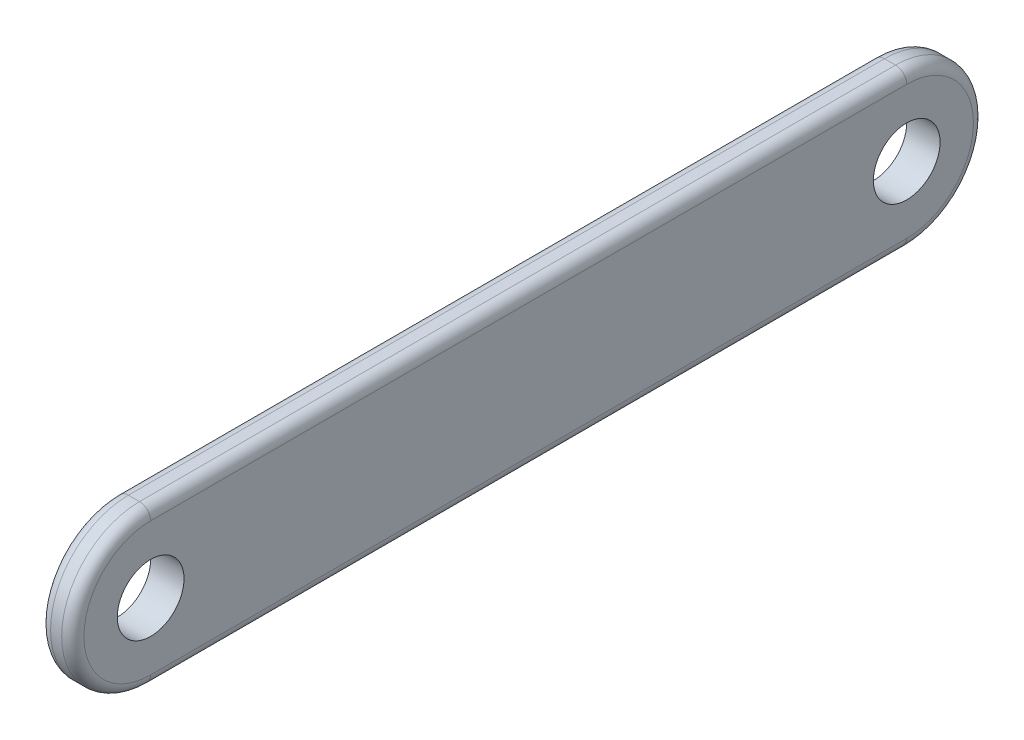
ISO-10303-21;
HEADER;
FILE_DESCRIPTION(('STEP AP214'),'2;1');
FILE_NAME('part.step','',(''),(''),'','','');
FILE_SCHEMA(('AUTOMOTIVE_DESIGN { 1 0 10303 214 1 1 1 1 }'));
ENDSEC;
DATA;
#1=APPLICATION_CONTEXT('core data for automotive mechanical design processes');
#2=APPLICATION_PROTOCOL_DEFINITION('international standard','automotive_design',2000,#1);
#3=PRODUCT_CONTEXT('',#1,'mechanical');
#4=PRODUCT('Part','Part','',(#3));
#5=PRODUCT_RELATED_PRODUCT_CATEGORY('part','',(#4));
#6=PRODUCT_DEFINITION_FORMATION('','',#4);
#7=PRODUCT_DEFINITION_CONTEXT('part definition',#1,'design');
#8=PRODUCT_DEFINITION('design','',#6,#7);
#9=PRODUCT_DEFINITION_SHAPE('','',#8);
#10=(LENGTH_UNIT() NAMED_UNIT(*) SI_UNIT(.MILLI.,.METRE.));
#11=(NAMED_UNIT(*) PLANE_ANGLE_UNIT() SI_UNIT($,.RADIAN.));
#12=(NAMED_UNIT(*) SI_UNIT($,.STERADIAN.) SOLID_ANGLE_UNIT());
#13=UNCERTAINTY_MEASURE_WITH_UNIT(LENGTH_MEASURE(1.E-05),#10,'distance_accuracy_value','');
#14=(GEOMETRIC_REPRESENTATION_CONTEXT(3) GLOBAL_UNCERTAINTY_ASSIGNED_CONTEXT((#13)) GLOBAL_UNIT_ASSIGNED_CONTEXT((#10,
#11,#12)) REPRESENTATION_CONTEXT('',''));
#15=CARTESIAN_POINT('',(0.,0.,0.));
#16=DIRECTION('',(0.,0.,1.));
#17=DIRECTION('',(1.,0.,0.));
#18=AXIS2_PLACEMENT_3D('',#15,#16,#17);
#19=CARTESIAN_POINT('',(3.,0.,34.));
#20=DIRECTION('',(1.,0.,0.));
#21=DIRECTION('',(0.,0.,-1.));
#22=AXIS2_PLACEMENT_3D('',#19,#20,#21);
#23=PLANE('',#22);
#24=CARTESIAN_POINT('',(3.,0.,-34.));
#25=DIRECTION('',(1.,0.,0.));
#26=DIRECTION('',(0.,0.,-1.));
#27=AXIS2_PLACEMENT_3D('',#24,#25,#26);
#28=CIRCLE('',#27,6.00000000000002);
#29=CARTESIAN_POINT('',(3.,-6.00000000000002,-34.));
#30=VERTEX_POINT('',#29);
#31=CARTESIAN_POINT('',(3.,6.00000000000002,-34.));
#32=VERTEX_POINT('',#31);
#33=EDGE_CURVE('E53',#30,#32,#28,.T.);
#34=ORIENTED_EDGE('',*,*,#33,.T.);
#35=DIRECTION('',(0.,0.,1.));
#36=VECTOR('',#35,1.);
#37=CARTESIAN_POINT('',(3.,6.00000000000002,34.));
#38=LINE('',#37,#36);
#39=CARTESIAN_POINT('',(3.,6.00000000000002,34.));
#40=VERTEX_POINT('',#39);
#41=EDGE_CURVE('E112',#32,#40,#38,.T.);
#42=ORIENTED_EDGE('',*,*,#41,.T.);
#43=CARTESIAN_POINT('',(3.,0.,34.));
#44=DIRECTION('',(1.,0.,0.));
#45=DIRECTION('',(0.,0.,-1.));
#46=AXIS2_PLACEMENT_3D('',#43,#44,#45);
#47=CIRCLE('',#46,6.00000000000002);
#48=CARTESIAN_POINT('',(3.,-6.00000000000001,34.));
#49=VERTEX_POINT('',#48);
#50=EDGE_CURVE('E136',#40,#49,#47,.T.);
#51=ORIENTED_EDGE('',*,*,#50,.T.);
#52=DIRECTION('',(0.,0.,-1.));
#53=VECTOR('',#52,1.);
#54=CARTESIAN_POINT('',(3.,-6.00000000000002,-34.));
#55=LINE('',#54,#53);
#56=EDGE_CURVE('E58',#49,#30,#55,.T.);
#57=ORIENTED_EDGE('',*,*,#56,.T.);
#58=EDGE_LOOP('',(#34,#42,#51,#57));
#59=FACE_BOUND('',#58,.T.);
#60=CARTESIAN_POINT('',(3.,0.,34.));
#61=DIRECTION('',(1.,0.,0.));
#62=DIRECTION('',(0.,0.,-1.));
#63=AXIS2_PLACEMENT_3D('',#60,#61,#62);
#64=CIRCLE('',#63,2.99999999999999);
#65=CARTESIAN_POINT('',(3.,0.,31.));
#66=VERTEX_POINT('',#65);
#67=EDGE_CURVE('E125',#66,#66,#64,.T.);
#68=ORIENTED_EDGE('',*,*,#67,.F.);
#69=EDGE_LOOP('',(#68));
#70=FACE_BOUND('',#69,.T.);
#71=CARTESIAN_POINT('',(3.,0.,-34.));
#72=DIRECTION('',(1.,0.,0.));
#73=DIRECTION('',(0.,0.,-1.));
#74=AXIS2_PLACEMENT_3D('',#71,#72,#73);
#75=CIRCLE('',#74,2.99999999999999);
#76=CARTESIAN_POINT('',(3.,0.,-37.));
#77=VERTEX_POINT('',#76);
#78=EDGE_CURVE('E165',#77,#77,#75,.T.);
#79=ORIENTED_EDGE('',*,*,#78,.F.);
#80=EDGE_LOOP('',(#79));
#81=FACE_BOUND('',#80,.T.);
#82=ADVANCED_FACE('F36',(#59,#70,#81),#23,.T.);
#83=CARTESIAN_POINT('',(0.,0.,34.));
#84=DIRECTION('',(1.,0.,0.));
#85=DIRECTION('',(0.,0.,-1.));
#86=AXIS2_PLACEMENT_3D('',#83,#84,#85);
#87=PLANE('',#86);
#88=CARTESIAN_POINT('',(0.,0.,34.));
#89=DIRECTION('',(1.,0.,0.));
#90=DIRECTION('',(0.,0.,-1.));
#91=AXIS2_PLACEMENT_3D('',#88,#89,#90);
#92=CIRCLE('',#91,6.00000000000002);
#93=CARTESIAN_POINT('',(0.,-6.00000000000001,34.));
#94=VERTEX_POINT('',#93);
#95=CARTESIAN_POINT('',(0.,6.00000000000002,34.));
#96=VERTEX_POINT('',#95);
#97=EDGE_CURVE('E183',#94,#96,#92,.F.);
#98=ORIENTED_EDGE('',*,*,#97,.T.);
#99=DIRECTION('',(0.,0.,1.));
#100=VECTOR('',#99,1.);
#101=CARTESIAN_POINT('',(0.,6.00000000000002,34.));
#102=LINE('',#101,#100);
#103=CARTESIAN_POINT('',(0.,6.00000000000002,-34.));
#104=VERTEX_POINT('',#103);
#105=EDGE_CURVE('E189',#96,#104,#102,.F.);
#106=ORIENTED_EDGE('',*,*,#105,.T.);
#107=CARTESIAN_POINT('',(0.,0.,-34.));
#108=DIRECTION('',(1.,0.,0.));
#109=DIRECTION('',(0.,0.,-1.));
#110=AXIS2_PLACEMENT_3D('',#107,#108,#109);
#111=CIRCLE('',#110,6.00000000000002);
#112=CARTESIAN_POINT('',(0.,-6.00000000000002,-34.));
#113=VERTEX_POINT('',#112);
#114=EDGE_CURVE('E187',#104,#113,#111,.F.);
#115=ORIENTED_EDGE('',*,*,#114,.T.);
#116=DIRECTION('',(0.,0.,-1.));
#117=VECTOR('',#116,1.);
#118=CARTESIAN_POINT('',(0.,-6.00000000000002,34.));
#119=LINE('',#118,#117);
#120=EDGE_CURVE('E185',#113,#94,#119,.F.);
#121=ORIENTED_EDGE('',*,*,#120,.T.);
#122=EDGE_LOOP('',(#98,#106,#115,#121));
#123=FACE_BOUND('',#122,.T.);
#124=CARTESIAN_POINT('',(0.,0.,34.));
#125=DIRECTION('',(1.,0.,0.));
#126=DIRECTION('',(0.,0.,-1.));
#127=AXIS2_PLACEMENT_3D('',#124,#125,#126);
#128=CIRCLE('',#127,2.99999999999999);
#129=CARTESIAN_POINT('',(0.,0.,31.));
#130=VERTEX_POINT('',#129);
#131=EDGE_CURVE('E170',#130,#130,#128,.T.);
#132=ORIENTED_EDGE('',*,*,#131,.T.);
#133=EDGE_LOOP('',(#132));
#134=FACE_BOUND('',#133,.T.);
#135=CARTESIAN_POINT('',(0.,0.,-34.));
#136=DIRECTION('',(1.,0.,0.));
#137=DIRECTION('',(0.,0.,-1.));
#138=AXIS2_PLACEMENT_3D('',#135,#136,#137);
#139=CIRCLE('',#138,2.99999999999999);
#140=CARTESIAN_POINT('',(0.,0.,-37.));
#141=VERTEX_POINT('',#140);
#142=EDGE_CURVE('E159',#141,#141,#139,.T.);
#143=ORIENTED_EDGE('',*,*,#142,.T.);
#144=EDGE_LOOP('',(#143));
#145=FACE_BOUND('',#144,.T.);
#146=ADVANCED_FACE('F229',(#123,#134,#145),#87,.F.);
#147=CARTESIAN_POINT('',(3.,0.,34.));
#148=DIRECTION('',(-1.,0.,0.));
#149=DIRECTION('',(0.,0.,1.));
#150=AXIS2_PLACEMENT_3D('',#147,#148,#149);
#151=CYLINDRICAL_SURFACE('',#150,7.00000000000002);
#152=DIRECTION('',(-1.,0.,0.));
#153=VECTOR('',#152,1.);
#154=CARTESIAN_POINT('',(3.,7.00000000000002,34.));
#155=LINE('',#154,#153);
#156=CARTESIAN_POINT('',(2.,7.00000000000002,34.));
#157=VERTEX_POINT('',#156);
#158=CARTESIAN_POINT('',(1.,7.00000000000002,34.));
#159=VERTEX_POINT('',#158);
#160=EDGE_CURVE('E105',#157,#159,#155,.T.);
#161=ORIENTED_EDGE('',*,*,#160,.T.);
#162=CARTESIAN_POINT('',(1.,0.,34.));
#163=DIRECTION('',(1.,0.,0.));
#164=DIRECTION('',(0.,0.,-1.));
#165=AXIS2_PLACEMENT_3D('',#162,#163,#164);
#166=CIRCLE('',#165,7.00000000000002);
#167=CARTESIAN_POINT('',(1.,-7.00000000000002,34.));
#168=VERTEX_POINT('',#167);
#169=EDGE_CURVE('E11',#159,#168,#166,.T.);
#170=ORIENTED_EDGE('',*,*,#169,.T.);
#171=DIRECTION('',(-1.,0.,0.));
#172=VECTOR('',#171,1.);
#173=CARTESIAN_POINT('',(3.,-7.00000000000002,34.));
#174=LINE('',#173,#172);
#175=CARTESIAN_POINT('',(2.,-7.00000000000002,34.));
#176=VERTEX_POINT('',#175);
#177=EDGE_CURVE('E107',#176,#168,#174,.T.);
#178=ORIENTED_EDGE('',*,*,#177,.F.);
#179=CARTESIAN_POINT('',(2.,0.,34.));
#180=DIRECTION('',(1.,0.,0.));
#181=DIRECTION('',(0.,0.,-1.));
#182=AXIS2_PLACEMENT_3D('',#179,#180,#181);
#183=CIRCLE('',#182,7.00000000000002);
#184=EDGE_CURVE('E45',#176,#157,#183,.F.);
#185=ORIENTED_EDGE('',*,*,#184,.T.);
#186=EDGE_LOOP('',(#161,#170,#178,#185));
#187=FACE_BOUND('',#186,.T.);
#188=ADVANCED_FACE('F104',(#187),#151,.T.);
#189=CARTESIAN_POINT('',(3.,-7.00000000000002,34.));
#190=DIRECTION('',(0.,1.,0.));
#191=DIRECTION('',(0.,0.,1.));
#192=AXIS2_PLACEMENT_3D('',#189,#190,#191);
#193=PLANE('',#192);
#194=ORIENTED_EDGE('',*,*,#177,.T.);
#195=DIRECTION('',(0.,0.,-1.));
#196=VECTOR('',#195,1.);
#197=CARTESIAN_POINT('',(1.,-7.00000000000002,34.));
#198=LINE('',#197,#196);
#199=CARTESIAN_POINT('',(1.,-7.00000000000001,-34.));
#200=VERTEX_POINT('',#199);
#201=EDGE_CURVE('E198',#168,#200,#198,.T.);
#202=ORIENTED_EDGE('',*,*,#201,.T.);
#203=DIRECTION('',(-1.,0.,0.));
#204=VECTOR('',#203,1.);
#205=CARTESIAN_POINT('',(3.,-7.00000000000001,-34.));
#206=LINE('',#205,#204);
#207=CARTESIAN_POINT('',(2.,-7.00000000000001,-34.));
#208=VERTEX_POINT('',#207);
#209=EDGE_CURVE('E178',#208,#200,#206,.T.);
#210=ORIENTED_EDGE('',*,*,#209,.F.);
#211=DIRECTION('',(0.,0.,-1.));
#212=VECTOR('',#211,1.);
#213=CARTESIAN_POINT('',(2.,-7.00000000000002,34.));
#214=LINE('',#213,#212);
#215=EDGE_CURVE('E196',#208,#176,#214,.F.);
#216=ORIENTED_EDGE('',*,*,#215,.T.);
#217=EDGE_LOOP('',(#194,#202,#210,#216));
#218=FACE_BOUND('',#217,.T.);
#219=ADVANCED_FACE('F211',(#218),#193,.F.);
#220=CARTESIAN_POINT('',(3.,0.,-34.));
#221=DIRECTION('',(-1.,0.,0.));
#222=DIRECTION('',(0.,0.,1.));
#223=AXIS2_PLACEMENT_3D('',#220,#221,#222);
#224=CYLINDRICAL_SURFACE('',#223,7.00000000000002);
#225=ORIENTED_EDGE('',*,*,#209,.T.);
#226=CARTESIAN_POINT('',(1.,0.,-34.));
#227=DIRECTION('',(1.,0.,0.));
#228=DIRECTION('',(0.,0.,-1.));
#229=AXIS2_PLACEMENT_3D('',#226,#227,#228);
#230=CIRCLE('',#229,7.00000000000002);
#231=CARTESIAN_POINT('',(1.,7.00000000000002,-34.));
#232=VERTEX_POINT('',#231);
#233=EDGE_CURVE('E194',#200,#232,#230,.T.);
#234=ORIENTED_EDGE('',*,*,#233,.T.);
#235=DIRECTION('',(-1.,0.,0.));
#236=VECTOR('',#235,1.);
#237=CARTESIAN_POINT('',(3.,7.00000000000002,-34.));
#238=LINE('',#237,#236);
#239=CARTESIAN_POINT('',(2.,7.00000000000002,-34.));
#240=VERTEX_POINT('',#239);
#241=EDGE_CURVE('E124',#240,#232,#238,.T.);
#242=ORIENTED_EDGE('',*,*,#241,.F.);
#243=CARTESIAN_POINT('',(2.,0.,-34.));
#244=DIRECTION('',(1.,0.,0.));
#245=DIRECTION('',(0.,0.,-1.));
#246=AXIS2_PLACEMENT_3D('',#243,#244,#245);
#247=CIRCLE('',#246,7.00000000000002);
#248=EDGE_CURVE('E192',#240,#208,#247,.F.);
#249=ORIENTED_EDGE('',*,*,#248,.T.);
#250=EDGE_LOOP('',(#225,#234,#242,#249));
#251=FACE_BOUND('',#250,.T.);
#252=ADVANCED_FACE('F209',(#251),#224,.T.);
#253=CARTESIAN_POINT('',(3.,7.00000000000002,34.));
#254=DIRECTION('',(0.,-1.,0.));
#255=DIRECTION('',(0.,0.,-1.));
#256=AXIS2_PLACEMENT_3D('',#253,#254,#255);
#257=PLANE('',#256);
#258=ORIENTED_EDGE('',*,*,#241,.T.);
#259=DIRECTION('',(0.,0.,1.));
#260=VECTOR('',#259,1.);
#261=CARTESIAN_POINT('',(1.,7.00000000000002,34.));
#262=LINE('',#261,#260);
#263=EDGE_CURVE('E123',#232,#159,#262,.T.);
#264=ORIENTED_EDGE('',*,*,#263,.T.);
#265=ORIENTED_EDGE('',*,*,#160,.F.);
#266=DIRECTION('',(0.,0.,1.));
#267=VECTOR('',#266,1.);
#268=CARTESIAN_POINT('',(2.,7.00000000000002,-34.));
#269=LINE('',#268,#267);
#270=EDGE_CURVE('E120',#157,#240,#269,.F.);
#271=ORIENTED_EDGE('',*,*,#270,.T.);
#272=EDGE_LOOP('',(#258,#264,#265,#271));
#273=FACE_BOUND('',#272,.T.);
#274=ADVANCED_FACE('F119',(#273),#257,.F.);
#275=CARTESIAN_POINT('',(3.,0.,34.));
#276=DIRECTION('',(-1.,0.,0.));
#277=DIRECTION('',(0.,0.,1.));
#278=AXIS2_PLACEMENT_3D('',#275,#276,#277);
#279=CYLINDRICAL_SURFACE('',#278,2.99999999999999);
#280=ORIENTED_EDGE('',*,*,#67,.T.);
#281=EDGE_LOOP('',(#280));
#282=FACE_BOUND('',#281,.T.);
#283=ORIENTED_EDGE('',*,*,#131,.F.);
#284=EDGE_LOOP('',(#283));
#285=FACE_BOUND('',#284,.T.);
#286=ADVANCED_FACE('F237',(#282,#285),#279,.F.);
#287=CARTESIAN_POINT('',(3.,0.,-34.));
#288=DIRECTION('',(-1.,0.,0.));
#289=DIRECTION('',(0.,0.,1.));
#290=AXIS2_PLACEMENT_3D('',#287,#288,#289);
#291=CYLINDRICAL_SURFACE('',#290,2.99999999999999);
#292=ORIENTED_EDGE('',*,*,#78,.T.);
#293=EDGE_LOOP('',(#292));
#294=FACE_BOUND('',#293,.T.);
#295=ORIENTED_EDGE('',*,*,#142,.F.);
#296=EDGE_LOOP('',(#295));
#297=FACE_BOUND('',#296,.T.);
#298=ADVANCED_FACE('F269',(#294,#297),#291,.F.);
#299=CARTESIAN_POINT('',(1.,-6.00000000000002,34.));
#300=DIRECTION('',(0.,0.,-1.));
#301=DIRECTION('',(-1.,0.,0.));
#302=AXIS2_PLACEMENT_3D('',#299,#300,#301);
#303=CYLINDRICAL_SURFACE('',#302,1.);
#304=CARTESIAN_POINT('',(1.,-6.00000000000002,34.));
#305=DIRECTION('',(0.,0.,1.));
#306=DIRECTION('',(1.,0.,0.));
#307=AXIS2_PLACEMENT_3D('',#304,#305,#306);
#308=CIRCLE('',#307,1.);
#309=EDGE_CURVE('E152',#94,#168,#308,.T.);
#310=ORIENTED_EDGE('',*,*,#309,.F.);
#311=ORIENTED_EDGE('',*,*,#120,.F.);
#312=CARTESIAN_POINT('',(1.,-6.00000000000002,-34.));
#313=DIRECTION('',(0.,0.,-1.));
#314=DIRECTION('',(-1.,0.,0.));
#315=AXIS2_PLACEMENT_3D('',#312,#313,#314);
#316=CIRCLE('',#315,1.);
#317=EDGE_CURVE('E141',#200,#113,#316,.T.);
#318=ORIENTED_EDGE('',*,*,#317,.F.);
#319=ORIENTED_EDGE('',*,*,#201,.F.);
#320=EDGE_LOOP('',(#310,#311,#318,#319));
#321=FACE_BOUND('',#320,.T.);
#322=ADVANCED_FACE('F214',(#321),#303,.T.);
#323=CARTESIAN_POINT('',(1.,0.,-34.));
#324=DIRECTION('',(1.,0.,0.));
#325=DIRECTION('',(0.,0.,-1.));
#326=AXIS2_PLACEMENT_3D('',#323,#324,#325);
#327=TOROIDAL_SURFACE('',#326,6.00000000000002,1.);
#328=ORIENTED_EDGE('',*,*,#317,.T.);
#329=ORIENTED_EDGE('',*,*,#114,.F.);
#330=CARTESIAN_POINT('',(1.,6.00000000000002,-34.));
#331=DIRECTION('',(0.,0.,1.));
#332=DIRECTION('',(1.,0.,0.));
#333=AXIS2_PLACEMENT_3D('',#330,#331,#332);
#334=CIRCLE('',#333,1.);
#335=EDGE_CURVE('E146',#232,#104,#334,.T.);
#336=ORIENTED_EDGE('',*,*,#335,.F.);
#337=ORIENTED_EDGE('',*,*,#233,.F.);
#338=EDGE_LOOP('',(#328,#329,#336,#337));
#339=FACE_BOUND('',#338,.T.);
#340=ADVANCED_FACE('F217',(#339),#327,.T.);
#341=CARTESIAN_POINT('',(1.,0.,34.));
#342=DIRECTION('',(1.,0.,0.));
#343=DIRECTION('',(0.,0.,-1.));
#344=AXIS2_PLACEMENT_3D('',#341,#342,#343);
#345=TOROIDAL_SURFACE('',#344,6.00000000000002,1.);
#346=ORIENTED_EDGE('',*,*,#309,.T.);
#347=ORIENTED_EDGE('',*,*,#169,.F.);
#348=CARTESIAN_POINT('',(1.,6.00000000000002,34.));
#349=DIRECTION('',(0.,0.,-1.));
#350=DIRECTION('',(-1.,0.,0.));
#351=AXIS2_PLACEMENT_3D('',#348,#349,#350);
#352=CIRCLE('',#351,1.);
#353=EDGE_CURVE('E144',#96,#159,#352,.T.);
#354=ORIENTED_EDGE('',*,*,#353,.F.);
#355=ORIENTED_EDGE('',*,*,#97,.F.);
#356=EDGE_LOOP('',(#346,#347,#354,#355));
#357=FACE_BOUND('',#356,.T.);
#358=ADVANCED_FACE('F220',(#357),#345,.T.);
#359=CARTESIAN_POINT('',(1.,6.00000000000002,34.));
#360=DIRECTION('',(0.,0.,1.));
#361=DIRECTION('',(1.,0.,0.));
#362=AXIS2_PLACEMENT_3D('',#359,#360,#361);
#363=CYLINDRICAL_SURFACE('',#362,1.);
#364=ORIENTED_EDGE('',*,*,#335,.T.);
#365=ORIENTED_EDGE('',*,*,#105,.F.);
#366=ORIENTED_EDGE('',*,*,#353,.T.);
#367=ORIENTED_EDGE('',*,*,#263,.F.);
#368=EDGE_LOOP('',(#364,#365,#366,#367));
#369=FACE_BOUND('',#368,.T.);
#370=ADVANCED_FACE('F218',(#369),#363,.T.);
#371=CARTESIAN_POINT('',(2.,-6.00000000000002,34.));
#372=DIRECTION('',(0.,0.,1.));
#373=DIRECTION('',(1.,0.,0.));
#374=AXIS2_PLACEMENT_3D('',#371,#372,#373);
#375=CYLINDRICAL_SURFACE('',#374,1.);
#376=CARTESIAN_POINT('',(2.,-6.00000000000002,34.));
#377=DIRECTION('',(0.,0.,1.));
#378=DIRECTION('',(1.,0.,0.));
#379=AXIS2_PLACEMENT_3D('',#376,#377,#378);
#380=CIRCLE('',#379,1.);
#381=EDGE_CURVE('E138',#176,#49,#380,.T.);
#382=ORIENTED_EDGE('',*,*,#381,.F.);
#383=ORIENTED_EDGE('',*,*,#215,.F.);
#384=CARTESIAN_POINT('',(2.,-6.00000000000002,-34.));
#385=DIRECTION('',(0.,0.,-1.));
#386=DIRECTION('',(-1.,0.,0.));
#387=AXIS2_PLACEMENT_3D('',#384,#385,#386);
#388=CIRCLE('',#387,1.);
#389=EDGE_CURVE('E40',#30,#208,#388,.T.);
#390=ORIENTED_EDGE('',*,*,#389,.F.);
#391=ORIENTED_EDGE('',*,*,#56,.F.);
#392=EDGE_LOOP('',(#382,#383,#390,#391));
#393=FACE_BOUND('',#392,.T.);
#394=ADVANCED_FACE('F38',(#393),#375,.T.);
#395=CARTESIAN_POINT('',(2.,0.,-34.));
#396=DIRECTION('',(1.,0.,0.));
#397=DIRECTION('',(0.,0.,-1.));
#398=AXIS2_PLACEMENT_3D('',#395,#396,#397);
#399=TOROIDAL_SURFACE('',#398,6.00000000000002,1.);
#400=ORIENTED_EDGE('',*,*,#389,.T.);
#401=ORIENTED_EDGE('',*,*,#248,.F.);
#402=CARTESIAN_POINT('',(2.,6.00000000000002,-34.));
#403=DIRECTION('',(0.,0.,1.));
#404=DIRECTION('',(1.,0.,0.));
#405=AXIS2_PLACEMENT_3D('',#402,#403,#404);
#406=CIRCLE('',#405,1.);
#407=EDGE_CURVE('E132',#32,#240,#406,.T.);
#408=ORIENTED_EDGE('',*,*,#407,.F.);
#409=ORIENTED_EDGE('',*,*,#33,.F.);
#410=EDGE_LOOP('',(#400,#401,#408,#409));
#411=FACE_BOUND('',#410,.T.);
#412=ADVANCED_FACE('F206',(#411),#399,.T.);
#413=CARTESIAN_POINT('',(2.,0.,34.));
#414=DIRECTION('',(1.,0.,0.));
#415=DIRECTION('',(0.,0.,-1.));
#416=AXIS2_PLACEMENT_3D('',#413,#414,#415);
#417=TOROIDAL_SURFACE('',#416,6.00000000000002,1.);
#418=ORIENTED_EDGE('',*,*,#381,.T.);
#419=ORIENTED_EDGE('',*,*,#50,.F.);
#420=CARTESIAN_POINT('',(2.,6.00000000000002,34.));
#421=DIRECTION('',(0.,0.,-1.));
#422=DIRECTION('',(-1.,0.,0.));
#423=AXIS2_PLACEMENT_3D('',#420,#421,#422);
#424=CIRCLE('',#423,1.);
#425=EDGE_CURVE('E130',#157,#40,#424,.T.);
#426=ORIENTED_EDGE('',*,*,#425,.F.);
#427=ORIENTED_EDGE('',*,*,#184,.F.);
#428=EDGE_LOOP('',(#418,#419,#426,#427));
#429=FACE_BOUND('',#428,.T.);
#430=ADVANCED_FACE('F135',(#429),#417,.T.);
#431=CARTESIAN_POINT('',(2.,6.00000000000002,34.));
#432=DIRECTION('',(0.,0.,-1.));
#433=DIRECTION('',(-1.,0.,0.));
#434=AXIS2_PLACEMENT_3D('',#431,#432,#433);
#435=CYLINDRICAL_SURFACE('',#434,1.);
#436=ORIENTED_EDGE('',*,*,#407,.T.);
#437=ORIENTED_EDGE('',*,*,#270,.F.);
#438=ORIENTED_EDGE('',*,*,#425,.T.);
#439=ORIENTED_EDGE('',*,*,#41,.F.);
#440=EDGE_LOOP('',(#436,#437,#438,#439));
#441=FACE_BOUND('',#440,.T.);
#442=ADVANCED_FACE('F128',(#441),#435,.T.);
#443=CLOSED_SHELL('',(#82,#146,#188,#219,#252,#274,#286,#298,#322,#340,#358,#370,#394,#412,#430,#442));
#444=MANIFOLD_SOLID_BREP('B2',#443);
#445=ADVANCED_BREP_SHAPE_REPRESENTATION('',(#18,#444),#14);
#446=SHAPE_DEFINITION_REPRESENTATION(#9,#445);
ENDSEC;
END-ISO-10303-21;
